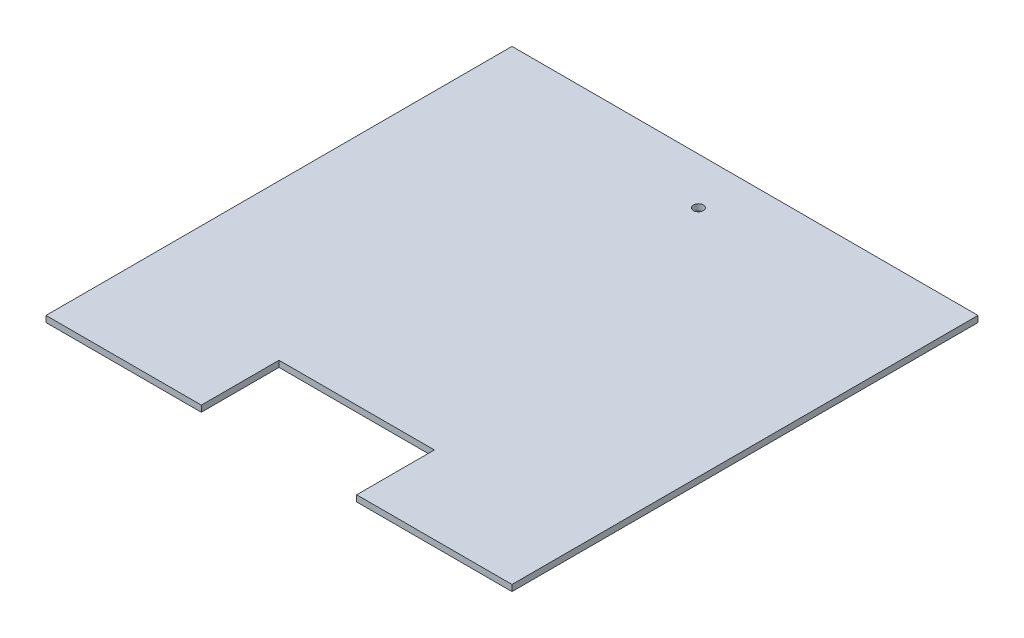
ISO-10303-21;
HEADER;
FILE_DESCRIPTION(('STEP AP214'),'2;1');
FILE_NAME('part.step','',(''),(''),'','','');
FILE_SCHEMA(('AUTOMOTIVE_DESIGN { 1 0 10303 214 1 1 1 1 }'));
ENDSEC;
DATA;
#1=APPLICATION_CONTEXT('core data for automotive mechanical design processes');
#2=APPLICATION_PROTOCOL_DEFINITION('international standard','automotive_design',2000,#1);
#3=PRODUCT_CONTEXT('',#1,'mechanical');
#4=PRODUCT('Part','Part','',(#3));
#5=PRODUCT_RELATED_PRODUCT_CATEGORY('part','',(#4));
#6=PRODUCT_DEFINITION_FORMATION('','',#4);
#7=PRODUCT_DEFINITION_CONTEXT('part definition',#1,'design');
#8=PRODUCT_DEFINITION('design','',#6,#7);
#9=PRODUCT_DEFINITION_SHAPE('','',#8);
#10=(LENGTH_UNIT() NAMED_UNIT(*) SI_UNIT(.MILLI.,.METRE.));
#11=(NAMED_UNIT(*) PLANE_ANGLE_UNIT() SI_UNIT($,.RADIAN.));
#12=(NAMED_UNIT(*) SI_UNIT($,.STERADIAN.) SOLID_ANGLE_UNIT());
#13=UNCERTAINTY_MEASURE_WITH_UNIT(LENGTH_MEASURE(1.E-05),#10,'distance_accuracy_value','');
#14=(GEOMETRIC_REPRESENTATION_CONTEXT(3) GLOBAL_UNCERTAINTY_ASSIGNED_CONTEXT((#13)) GLOBAL_UNIT_ASSIGNED_CONTEXT((#10,
#11,#12)) REPRESENTATION_CONTEXT('',''));
#15=CARTESIAN_POINT('',(0.,0.,0.));
#16=DIRECTION('',(0.,0.,1.));
#17=DIRECTION('',(1.,0.,0.));
#18=AXIS2_PLACEMENT_3D('',#15,#16,#17);
#19=CARTESIAN_POINT('',(-95.25,2.54,95.25));
#20=DIRECTION('',(0.,0.,-1.));
#21=DIRECTION('',(-1.,0.,0.));
#22=AXIS2_PLACEMENT_3D('',#19,#20,#21);
#23=PLANE('',#22);
#24=DIRECTION('',(1.,0.,0.));
#25=VECTOR('',#24,1.);
#26=CARTESIAN_POINT('',(-95.25,2.54,95.25));
#27=LINE('',#26,#25);
#28=CARTESIAN_POINT('',(31.75,2.54,95.25));
#29=VERTEX_POINT('',#28);
#30=CARTESIAN_POINT('',(95.25,2.54,95.25));
#31=VERTEX_POINT('',#30);
#32=EDGE_CURVE('E63',#29,#31,#27,.T.);
#33=ORIENTED_EDGE('',*,*,#32,.F.);
#34=DIRECTION('',(0.,1.,0.));
#35=VECTOR('',#34,1.);
#36=CARTESIAN_POINT('',(31.75,0.,95.25));
#37=LINE('',#36,#35);
#38=CARTESIAN_POINT('',(31.75,0.,95.25));
#39=VERTEX_POINT('',#38);
#40=EDGE_CURVE('E149',#39,#29,#37,.T.);
#41=ORIENTED_EDGE('',*,*,#40,.F.);
#42=DIRECTION('',(1.,0.,0.));
#43=VECTOR('',#42,1.);
#44=CARTESIAN_POINT('',(-95.25,0.,95.25));
#45=LINE('',#44,#43);
#46=CARTESIAN_POINT('',(95.25,0.,95.25));
#47=VERTEX_POINT('',#46);
#48=EDGE_CURVE('E85',#39,#47,#45,.T.);
#49=ORIENTED_EDGE('',*,*,#48,.T.);
#50=DIRECTION('',(0.,-1.,0.));
#51=VECTOR('',#50,1.);
#52=CARTESIAN_POINT('',(95.25,2.54,95.25));
#53=LINE('',#52,#51);
#54=EDGE_CURVE('E172',#31,#47,#53,.T.);
#55=ORIENTED_EDGE('',*,*,#54,.F.);
#56=EDGE_LOOP('',(#33,#41,#49,#55));
#57=FACE_BOUND('',#56,.T.);
#58=ADVANCED_FACE('F38',(#57),#23,.F.);
#59=CARTESIAN_POINT('',(95.25,2.54,95.25));
#60=DIRECTION('',(-1.,0.,0.));
#61=DIRECTION('',(0.,0.,1.));
#62=AXIS2_PLACEMENT_3D('',#59,#60,#61);
#63=PLANE('',#62);
#64=DIRECTION('',(0.,0.,-1.));
#65=VECTOR('',#64,1.);
#66=CARTESIAN_POINT('',(95.25,0.,95.25));
#67=LINE('',#66,#65);
#68=CARTESIAN_POINT('',(95.25,0.,-95.25));
#69=VERTEX_POINT('',#68);
#70=EDGE_CURVE('E152',#47,#69,#67,.T.);
#71=ORIENTED_EDGE('',*,*,#70,.T.);
#72=DIRECTION('',(0.,-1.,0.));
#73=VECTOR('',#72,1.);
#74=CARTESIAN_POINT('',(95.25,2.54,-95.25));
#75=LINE('',#74,#73);
#76=CARTESIAN_POINT('',(95.25,2.54,-95.25));
#77=VERTEX_POINT('',#76);
#78=EDGE_CURVE('E11',#77,#69,#75,.T.);
#79=ORIENTED_EDGE('',*,*,#78,.F.);
#80=DIRECTION('',(0.,0.,-1.));
#81=VECTOR('',#80,1.);
#82=CARTESIAN_POINT('',(95.25,2.54,95.25));
#83=LINE('',#82,#81);
#84=EDGE_CURVE('E159',#31,#77,#83,.T.);
#85=ORIENTED_EDGE('',*,*,#84,.F.);
#86=ORIENTED_EDGE('',*,*,#54,.T.);
#87=EDGE_LOOP('',(#71,#79,#85,#86));
#88=FACE_BOUND('',#87,.T.);
#89=ADVANCED_FACE('F40',(#88),#63,.F.);
#90=CARTESIAN_POINT('',(-95.25,2.54,-95.25));
#91=DIRECTION('',(0.,0.,1.));
#92=DIRECTION('',(1.,0.,0.));
#93=AXIS2_PLACEMENT_3D('',#90,#91,#92);
#94=PLANE('',#93);
#95=DIRECTION('',(-1.,0.,0.));
#96=VECTOR('',#95,1.);
#97=CARTESIAN_POINT('',(-95.25,0.,-95.25));
#98=LINE('',#97,#96);
#99=CARTESIAN_POINT('',(-95.25,0.,-95.25));
#100=VERTEX_POINT('',#99);
#101=EDGE_CURVE('E176',#69,#100,#98,.T.);
#102=ORIENTED_EDGE('',*,*,#101,.T.);
#103=DIRECTION('',(0.,-1.,0.));
#104=VECTOR('',#103,1.);
#105=CARTESIAN_POINT('',(-95.25,2.54,-95.25));
#106=LINE('',#105,#104);
#107=CARTESIAN_POINT('',(-95.25,2.54,-95.25));
#108=VERTEX_POINT('',#107);
#109=EDGE_CURVE('E47',#108,#100,#106,.T.);
#110=ORIENTED_EDGE('',*,*,#109,.F.);
#111=DIRECTION('',(-1.,0.,0.));
#112=VECTOR('',#111,1.);
#113=CARTESIAN_POINT('',(-95.25,2.54,-95.25));
#114=LINE('',#113,#112);
#115=EDGE_CURVE('E92',#77,#108,#114,.T.);
#116=ORIENTED_EDGE('',*,*,#115,.F.);
#117=ORIENTED_EDGE('',*,*,#78,.T.);
#118=EDGE_LOOP('',(#102,#110,#116,#117));
#119=FACE_BOUND('',#118,.T.);
#120=ADVANCED_FACE('F206',(#119),#94,.F.);
#121=CARTESIAN_POINT('',(-95.25,2.54,95.25));
#122=DIRECTION('',(1.,0.,0.));
#123=DIRECTION('',(0.,0.,-1.));
#124=AXIS2_PLACEMENT_3D('',#121,#122,#123);
#125=PLANE('',#124);
#126=DIRECTION('',(0.,0.,1.));
#127=VECTOR('',#126,1.);
#128=CARTESIAN_POINT('',(-95.25,0.,95.25));
#129=LINE('',#128,#127);
#130=CARTESIAN_POINT('',(-95.25,0.,95.25));
#131=VERTEX_POINT('',#130);
#132=EDGE_CURVE('E179',#100,#131,#129,.T.);
#133=ORIENTED_EDGE('',*,*,#132,.T.);
#134=DIRECTION('',(0.,-1.,0.));
#135=VECTOR('',#134,1.);
#136=CARTESIAN_POINT('',(-95.25,2.54,95.25));
#137=LINE('',#136,#135);
#138=CARTESIAN_POINT('',(-95.25,2.54,95.25));
#139=VERTEX_POINT('',#138);
#140=EDGE_CURVE('E187',#139,#131,#137,.T.);
#141=ORIENTED_EDGE('',*,*,#140,.F.);
#142=DIRECTION('',(0.,0.,1.));
#143=VECTOR('',#142,1.);
#144=CARTESIAN_POINT('',(-95.25,2.54,95.25));
#145=LINE('',#144,#143);
#146=EDGE_CURVE('E165',#108,#139,#145,.T.);
#147=ORIENTED_EDGE('',*,*,#146,.F.);
#148=ORIENTED_EDGE('',*,*,#109,.T.);
#149=EDGE_LOOP('',(#133,#141,#147,#148));
#150=FACE_BOUND('',#149,.T.);
#151=ADVANCED_FACE('F195',(#150),#125,.F.);
#152=CARTESIAN_POINT('',(-31.75,0.,95.25));
#153=VERTEX_POINT('',#152);
#154=EDGE_CURVE('E162',#131,#153,#45,.T.);
#155=ORIENTED_EDGE('',*,*,#154,.T.);
#156=DIRECTION('',(0.,1.,0.));
#157=VECTOR('',#156,1.);
#158=CARTESIAN_POINT('',(-31.75,0.,95.25));
#159=LINE('',#158,#157);
#160=CARTESIAN_POINT('',(-31.75,2.54,95.25));
#161=VERTEX_POINT('',#160);
#162=EDGE_CURVE('E153',#153,#161,#159,.T.);
#163=ORIENTED_EDGE('',*,*,#162,.T.);
#164=EDGE_CURVE('E168',#139,#161,#27,.T.);
#165=ORIENTED_EDGE('',*,*,#164,.F.);
#166=ORIENTED_EDGE('',*,*,#140,.T.);
#167=EDGE_LOOP('',(#155,#163,#165,#166));
#168=FACE_BOUND('',#167,.T.);
#169=ADVANCED_FACE('F199',(#168),#23,.F.);
#170=CARTESIAN_POINT('',(0.,2.54,0.));
#171=DIRECTION('',(0.,-1.,0.));
#172=DIRECTION('',(0.,0.,-1.));
#173=AXIS2_PLACEMENT_3D('',#170,#171,#172);
#174=PLANE('',#173);
#175=CARTESIAN_POINT('',(0.000813672640931351,2.54,-76.1991863273571));
#176=DIRECTION('',(0.,1.,0.));
#177=DIRECTION('',(0.,0.,1.));
#178=AXIS2_PLACEMENT_3D('',#175,#176,#177);
#179=CIRCLE('',#178,2.032);
#180=CARTESIAN_POINT('',(0.000813672640931351,2.54,-74.1671863273571));
#181=VERTEX_POINT('',#180);
#182=EDGE_CURVE('E247',#181,#181,#179,.T.);
#183=ORIENTED_EDGE('',*,*,#182,.F.);
#184=EDGE_LOOP('',(#183));
#185=FACE_BOUND('',#184,.T.);
#186=DIRECTION('',(-1.,0.,0.));
#187=VECTOR('',#186,1.);
#188=CARTESIAN_POINT('',(-31.75,2.54,63.5));
#189=LINE('',#188,#187);
#190=CARTESIAN_POINT('',(31.75,2.54,63.5));
#191=VERTEX_POINT('',#190);
#192=CARTESIAN_POINT('',(-31.75,2.54,63.5));
#193=VERTEX_POINT('',#192);
#194=EDGE_CURVE('E137',#191,#193,#189,.T.);
#195=ORIENTED_EDGE('',*,*,#194,.F.);
#196=DIRECTION('',(0.,0.,-1.));
#197=VECTOR('',#196,1.);
#198=CARTESIAN_POINT('',(31.75,2.54,95.25));
#199=LINE('',#198,#197);
#200=EDGE_CURVE('E118',#29,#191,#199,.T.);
#201=ORIENTED_EDGE('',*,*,#200,.F.);
#202=ORIENTED_EDGE('',*,*,#32,.T.);
#203=ORIENTED_EDGE('',*,*,#84,.T.);
#204=ORIENTED_EDGE('',*,*,#115,.T.);
#205=ORIENTED_EDGE('',*,*,#146,.T.);
#206=ORIENTED_EDGE('',*,*,#164,.T.);
#207=DIRECTION('',(0.,0.,1.));
#208=VECTOR('',#207,1.);
#209=CARTESIAN_POINT('',(-31.75,2.54,95.25));
#210=LINE('',#209,#208);
#211=EDGE_CURVE('E134',#193,#161,#210,.T.);
#212=ORIENTED_EDGE('',*,*,#211,.F.);
#213=EDGE_LOOP('',(#195,#201,#202,#203,#204,#205,#206,#212));
#214=FACE_BOUND('',#213,.T.);
#215=ADVANCED_FACE('F202',(#185,#214),#174,.F.);
#216=CARTESIAN_POINT('',(0.,0.,0.));
#217=DIRECTION('',(0.,-1.,0.));
#218=DIRECTION('',(0.,0.,-1.));
#219=AXIS2_PLACEMENT_3D('',#216,#217,#218);
#220=PLANE('',#219);
#221=CARTESIAN_POINT('',(0.000813672640931351,0.,-76.1991863273571));
#222=DIRECTION('',(0.,-1.,0.));
#223=DIRECTION('',(0.,0.,-1.));
#224=AXIS2_PLACEMENT_3D('',#221,#222,#223);
#225=CIRCLE('',#224,2.032);
#226=CARTESIAN_POINT('',(0.000813672640931351,0.,-78.2311863273571));
#227=VERTEX_POINT('',#226);
#228=EDGE_CURVE('E140',#227,#227,#225,.F.);
#229=ORIENTED_EDGE('',*,*,#228,.T.);
#230=EDGE_LOOP('',(#229));
#231=FACE_BOUND('',#230,.T.);
#232=DIRECTION('',(0.,0.,-1.));
#233=VECTOR('',#232,1.);
#234=CARTESIAN_POINT('',(31.75,0.,95.25));
#235=LINE('',#234,#233);
#236=CARTESIAN_POINT('',(31.75,0.,63.5));
#237=VERTEX_POINT('',#236);
#238=EDGE_CURVE('E117',#39,#237,#235,.T.);
#239=ORIENTED_EDGE('',*,*,#238,.T.);
#240=DIRECTION('',(-1.,0.,0.));
#241=VECTOR('',#240,1.);
#242=CARTESIAN_POINT('',(-31.75,0.,63.5));
#243=LINE('',#242,#241);
#244=CARTESIAN_POINT('',(-31.75,0.,63.5));
#245=VERTEX_POINT('',#244);
#246=EDGE_CURVE('E126',#237,#245,#243,.T.);
#247=ORIENTED_EDGE('',*,*,#246,.T.);
#248=DIRECTION('',(0.,0.,1.));
#249=VECTOR('',#248,1.);
#250=CARTESIAN_POINT('',(-31.75,0.,95.25));
#251=LINE('',#250,#249);
#252=EDGE_CURVE('E54',#245,#153,#251,.T.);
#253=ORIENTED_EDGE('',*,*,#252,.T.);
#254=ORIENTED_EDGE('',*,*,#154,.F.);
#255=ORIENTED_EDGE('',*,*,#132,.F.);
#256=ORIENTED_EDGE('',*,*,#101,.F.);
#257=ORIENTED_EDGE('',*,*,#70,.F.);
#258=ORIENTED_EDGE('',*,*,#48,.F.);
#259=EDGE_LOOP('',(#239,#247,#253,#254,#255,#256,#257,#258));
#260=FACE_BOUND('',#259,.T.);
#261=ADVANCED_FACE('F131',(#231,#260),#220,.T.);
#262=CARTESIAN_POINT('',(31.75,0.,95.25));
#263=DIRECTION('',(1.,0.,0.));
#264=DIRECTION('',(0.,0.,-1.));
#265=AXIS2_PLACEMENT_3D('',#262,#263,#264);
#266=PLANE('',#265);
#267=ORIENTED_EDGE('',*,*,#200,.T.);
#268=DIRECTION('',(0.,1.,0.));
#269=VECTOR('',#268,1.);
#270=CARTESIAN_POINT('',(31.75,0.,63.5));
#271=LINE('',#270,#269);
#272=EDGE_CURVE('E113',#237,#191,#271,.T.);
#273=ORIENTED_EDGE('',*,*,#272,.F.);
#274=ORIENTED_EDGE('',*,*,#238,.F.);
#275=ORIENTED_EDGE('',*,*,#40,.T.);
#276=EDGE_LOOP('',(#267,#273,#274,#275));
#277=FACE_BOUND('',#276,.T.);
#278=ADVANCED_FACE('F115',(#277),#266,.F.);
#279=CARTESIAN_POINT('',(-31.75,0.,95.25));
#280=DIRECTION('',(-1.,0.,0.));
#281=DIRECTION('',(0.,0.,1.));
#282=AXIS2_PLACEMENT_3D('',#279,#280,#281);
#283=PLANE('',#282);
#284=ORIENTED_EDGE('',*,*,#211,.T.);
#285=ORIENTED_EDGE('',*,*,#162,.F.);
#286=ORIENTED_EDGE('',*,*,#252,.F.);
#287=DIRECTION('',(0.,1.,0.));
#288=VECTOR('',#287,1.);
#289=CARTESIAN_POINT('',(-31.75,0.,63.5));
#290=LINE('',#289,#288);
#291=EDGE_CURVE('E123',#245,#193,#290,.T.);
#292=ORIENTED_EDGE('',*,*,#291,.T.);
#293=EDGE_LOOP('',(#284,#285,#286,#292));
#294=FACE_BOUND('',#293,.T.);
#295=ADVANCED_FACE('F235',(#294),#283,.F.);
#296=CARTESIAN_POINT('',(-31.75,0.,63.5));
#297=DIRECTION('',(0.,0.,-1.));
#298=DIRECTION('',(-1.,0.,0.));
#299=AXIS2_PLACEMENT_3D('',#296,#297,#298);
#300=PLANE('',#299);
#301=ORIENTED_EDGE('',*,*,#194,.T.);
#302=ORIENTED_EDGE('',*,*,#291,.F.);
#303=ORIENTED_EDGE('',*,*,#246,.F.);
#304=ORIENTED_EDGE('',*,*,#272,.T.);
#305=EDGE_LOOP('',(#301,#302,#303,#304));
#306=FACE_BOUND('',#305,.T.);
#307=ADVANCED_FACE('F127',(#306),#300,.F.);
#308=CARTESIAN_POINT('',(0.000813672640931351,-5.74736391748427,-76.1991863273571));
#309=DIRECTION('',(0.,1.,0.));
#310=DIRECTION('',(0.,0.,1.));
#311=AXIS2_PLACEMENT_3D('',#308,#309,#310);
#312=CYLINDRICAL_SURFACE('',#311,2.032);
#313=ORIENTED_EDGE('',*,*,#182,.T.);
#314=EDGE_LOOP('',(#313));
#315=FACE_BOUND('',#314,.T.);
#316=ORIENTED_EDGE('',*,*,#228,.F.);
#317=EDGE_LOOP('',(#316));
#318=FACE_BOUND('',#317,.T.);
#319=ADVANCED_FACE('F238',(#315,#318),#312,.F.);
#320=CLOSED_SHELL('',(#58,#89,#120,#151,#169,#215,#261,#278,#295,#307,#319));
#321=MANIFOLD_SOLID_BREP('B2',#320);
#322=ADVANCED_BREP_SHAPE_REPRESENTATION('',(#18,#321),#14);
#323=SHAPE_DEFINITION_REPRESENTATION(#9,#322);
ENDSEC;
END-ISO-10303-21;
